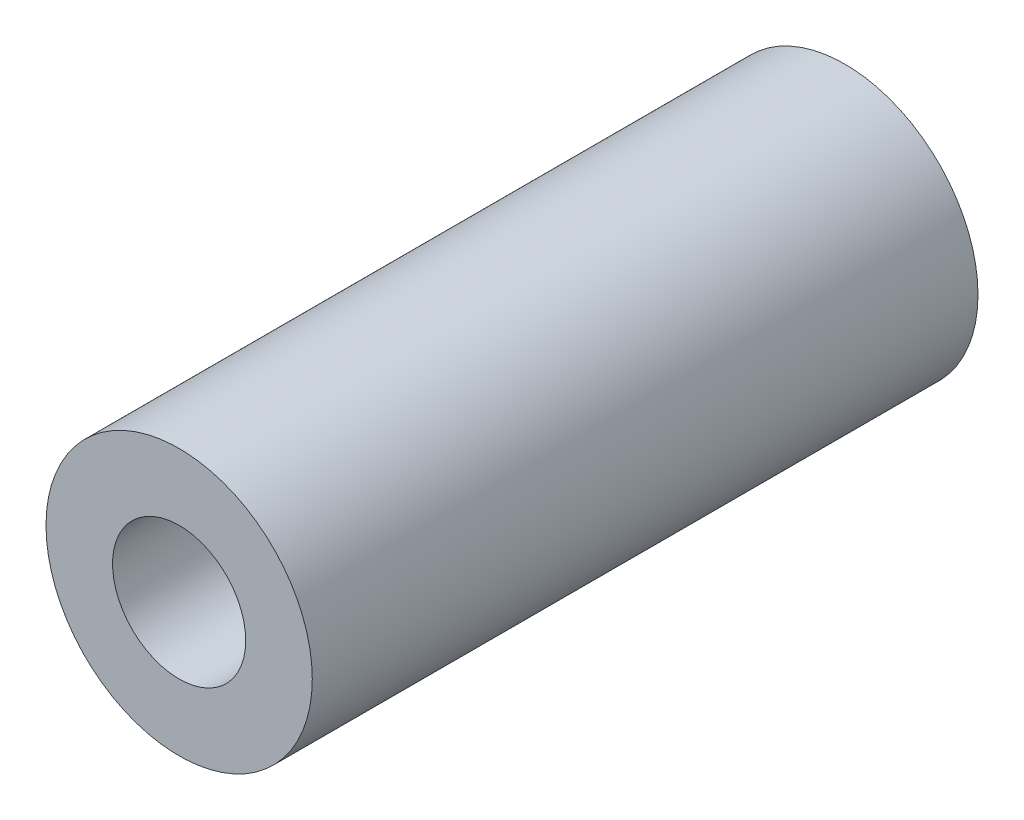
ISO-10303-21;
HEADER;
FILE_DESCRIPTION(('STEP AP214'),'2;1');
FILE_NAME('part.step','',(''),(''),'','','');
FILE_SCHEMA(('AUTOMOTIVE_DESIGN { 1 0 10303 214 1 1 1 1 }'));
ENDSEC;
DATA;
#1=APPLICATION_CONTEXT('core data for automotive mechanical design processes');
#2=APPLICATION_PROTOCOL_DEFINITION('international standard','automotive_design',2000,#1);
#3=PRODUCT_CONTEXT('',#1,'mechanical');
#4=PRODUCT('Part','Part','',(#3));
#5=PRODUCT_RELATED_PRODUCT_CATEGORY('part','',(#4));
#6=PRODUCT_DEFINITION_FORMATION('','',#4);
#7=PRODUCT_DEFINITION_CONTEXT('part definition',#1,'design');
#8=PRODUCT_DEFINITION('design','',#6,#7);
#9=PRODUCT_DEFINITION_SHAPE('','',#8);
#10=(LENGTH_UNIT() NAMED_UNIT(*) SI_UNIT(.MILLI.,.METRE.));
#11=(NAMED_UNIT(*) PLANE_ANGLE_UNIT() SI_UNIT($,.RADIAN.));
#12=(NAMED_UNIT(*) SI_UNIT($,.STERADIAN.) SOLID_ANGLE_UNIT());
#13=UNCERTAINTY_MEASURE_WITH_UNIT(LENGTH_MEASURE(1.E-05),#10,'distance_accuracy_value','');
#14=(GEOMETRIC_REPRESENTATION_CONTEXT(3) GLOBAL_UNCERTAINTY_ASSIGNED_CONTEXT((#13)) GLOBAL_UNIT_ASSIGNED_CONTEXT((#10,
#11,#12)) REPRESENTATION_CONTEXT('',''));
#15=CARTESIAN_POINT('',(0.,0.,0.));
#16=DIRECTION('',(0.,0.,1.));
#17=DIRECTION('',(1.,0.,0.));
#18=AXIS2_PLACEMENT_3D('',#15,#16,#17);
#19=CARTESIAN_POINT('',(0.,0.,15.));
#20=DIRECTION('',(0.,0.,1.));
#21=DIRECTION('',(1.,0.,0.));
#22=AXIS2_PLACEMENT_3D('',#19,#20,#21);
#23=PLANE('',#22);
#24=CARTESIAN_POINT('',(0.,0.,15.));
#25=DIRECTION('',(0.,0.,1.));
#26=DIRECTION('',(1.,0.,0.));
#27=AXIS2_PLACEMENT_3D('',#24,#25,#26);
#28=CIRCLE('',#27,3.);
#29=CARTESIAN_POINT('',(3.,0.,15.));
#30=VERTEX_POINT('',#29);
#31=EDGE_CURVE('E10',#30,#30,#28,.T.);
#32=ORIENTED_EDGE('',*,*,#31,.T.);
#33=EDGE_LOOP('',(#32));
#34=FACE_BOUND('',#33,.T.);
#35=CARTESIAN_POINT('',(0.,0.,15.));
#36=DIRECTION('',(0.,0.,1.));
#37=DIRECTION('',(1.,0.,0.));
#38=AXIS2_PLACEMENT_3D('',#35,#36,#37);
#39=CIRCLE('',#38,1.5);
#40=CARTESIAN_POINT('',(1.5,0.,15.));
#41=VERTEX_POINT('',#40);
#42=EDGE_CURVE('E42',#41,#41,#39,.T.);
#43=ORIENTED_EDGE('',*,*,#42,.F.);
#44=EDGE_LOOP('',(#43));
#45=FACE_BOUND('',#44,.T.);
#46=ADVANCED_FACE('F31',(#34,#45),#23,.T.);
#47=CARTESIAN_POINT('',(0.,0.,0.));
#48=DIRECTION('',(0.,0.,1.));
#49=DIRECTION('',(1.,0.,0.));
#50=AXIS2_PLACEMENT_3D('',#47,#48,#49);
#51=PLANE('',#50);
#52=CARTESIAN_POINT('',(0.,0.,0.));
#53=DIRECTION('',(0.,0.,1.));
#54=DIRECTION('',(1.,0.,0.));
#55=AXIS2_PLACEMENT_3D('',#52,#53,#54);
#56=CIRCLE('',#55,3.);
#57=CARTESIAN_POINT('',(3.,0.,0.));
#58=VERTEX_POINT('',#57);
#59=EDGE_CURVE('E35',#58,#58,#56,.T.);
#60=ORIENTED_EDGE('',*,*,#59,.F.);
#61=EDGE_LOOP('',(#60));
#62=FACE_BOUND('',#61,.T.);
#63=CARTESIAN_POINT('',(0.,0.,0.));
#64=DIRECTION('',(0.,0.,1.));
#65=DIRECTION('',(1.,0.,0.));
#66=AXIS2_PLACEMENT_3D('',#63,#64,#65);
#67=CIRCLE('',#66,1.5);
#68=CARTESIAN_POINT('',(1.5,0.,0.));
#69=VERTEX_POINT('',#68);
#70=EDGE_CURVE('E44',#69,#69,#67,.T.);
#71=ORIENTED_EDGE('',*,*,#70,.T.);
#72=EDGE_LOOP('',(#71));
#73=FACE_BOUND('',#72,.T.);
#74=ADVANCED_FACE('F54',(#62,#73),#51,.F.);
#75=CARTESIAN_POINT('',(0.,0.,15.));
#76=DIRECTION('',(0.,0.,-1.));
#77=DIRECTION('',(-1.,0.,0.));
#78=AXIS2_PLACEMENT_3D('',#75,#76,#77);
#79=CYLINDRICAL_SURFACE('',#78,3.);
#80=ORIENTED_EDGE('',*,*,#31,.F.);
#81=EDGE_LOOP('',(#80));
#82=FACE_BOUND('',#81,.T.);
#83=ORIENTED_EDGE('',*,*,#59,.T.);
#84=EDGE_LOOP('',(#83));
#85=FACE_BOUND('',#84,.T.);
#86=ADVANCED_FACE('F33',(#82,#85),#79,.T.);
#87=CARTESIAN_POINT('',(0.,0.,15.));
#88=DIRECTION('',(0.,0.,-1.));
#89=DIRECTION('',(-1.,0.,0.));
#90=AXIS2_PLACEMENT_3D('',#87,#88,#89);
#91=CYLINDRICAL_SURFACE('',#90,1.5);
#92=ORIENTED_EDGE('',*,*,#42,.T.);
#93=EDGE_LOOP('',(#92));
#94=FACE_BOUND('',#93,.T.);
#95=ORIENTED_EDGE('',*,*,#70,.F.);
#96=EDGE_LOOP('',(#95));
#97=FACE_BOUND('',#96,.T.);
#98=ADVANCED_FACE('F50',(#94,#97),#91,.F.);
#99=CLOSED_SHELL('',(#46,#74,#86,#98));
#100=MANIFOLD_SOLID_BREP('B2',#99);
#101=ADVANCED_BREP_SHAPE_REPRESENTATION('',(#18,#100),#14);
#102=SHAPE_DEFINITION_REPRESENTATION(#9,#101);
ENDSEC;
END-ISO-10303-21;
